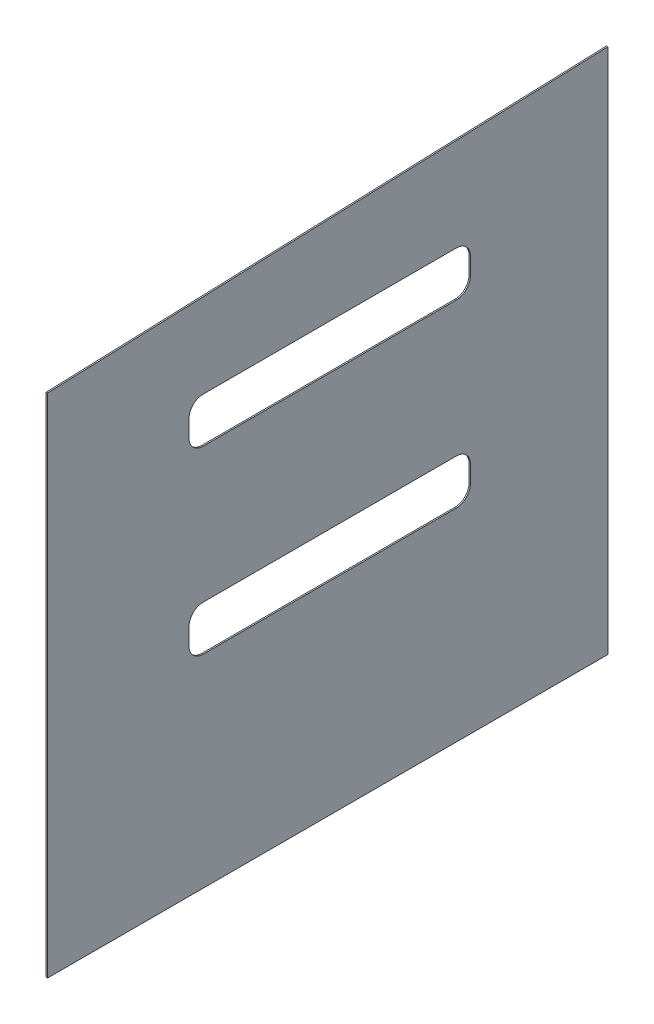
ISO-10303-21;
HEADER;
FILE_DESCRIPTION(('STEP AP214'),'2;1');
FILE_NAME('part.step','',(''),(''),'','','');
FILE_SCHEMA(('AUTOMOTIVE_DESIGN { 1 0 10303 214 1 1 1 1 }'));
ENDSEC;
DATA;
#1=APPLICATION_CONTEXT('core data for automotive mechanical design processes');
#2=APPLICATION_PROTOCOL_DEFINITION('international standard','automotive_design',2000,#1);
#3=PRODUCT_CONTEXT('',#1,'mechanical');
#4=PRODUCT('Part','Part','',(#3));
#5=PRODUCT_RELATED_PRODUCT_CATEGORY('part','',(#4));
#6=PRODUCT_DEFINITION_FORMATION('','',#4);
#7=PRODUCT_DEFINITION_CONTEXT('part definition',#1,'design');
#8=PRODUCT_DEFINITION('design','',#6,#7);
#9=PRODUCT_DEFINITION_SHAPE('','',#8);
#10=(LENGTH_UNIT() NAMED_UNIT(*) SI_UNIT(.MILLI.,.METRE.));
#11=(NAMED_UNIT(*) PLANE_ANGLE_UNIT() SI_UNIT($,.RADIAN.));
#12=(NAMED_UNIT(*) SI_UNIT($,.STERADIAN.) SOLID_ANGLE_UNIT());
#13=UNCERTAINTY_MEASURE_WITH_UNIT(LENGTH_MEASURE(1.E-05),#10,'distance_accuracy_value','');
#14=(GEOMETRIC_REPRESENTATION_CONTEXT(3) GLOBAL_UNCERTAINTY_ASSIGNED_CONTEXT((#13)) GLOBAL_UNIT_ASSIGNED_CONTEXT((#10,
#11,#12)) REPRESENTATION_CONTEXT('',''));
#15=CARTESIAN_POINT('',(0.,0.,0.));
#16=DIRECTION('',(0.,0.,1.));
#17=DIRECTION('',(1.,0.,0.));
#18=AXIS2_PLACEMENT_3D('',#15,#16,#17);
#19=CARTESIAN_POINT('',(6.35,1838.45729166667,746.398166827347));
#20=DIRECTION('',(0.,0.,-1.));
#21=DIRECTION('',(0.,1.,0.));
#22=AXIS2_PLACEMENT_3D('',#19,#20,#21);
#23=PLANE('',#22);
#24=DIRECTION('',(0.,-1.,0.));
#25=VECTOR('',#24,1.);
#26=CARTESIAN_POINT('',(0.,1838.45729166667,746.398166827347));
#27=LINE('',#26,#25);
#28=CARTESIAN_POINT('',(0.,1838.45729166667,746.398166827347));
#29=VERTEX_POINT('',#28);
#30=CARTESIAN_POINT('',(0.,-447.542708333333,746.398166827347));
#31=VERTEX_POINT('',#30);
#32=EDGE_CURVE('E217',#29,#31,#27,.T.);
#33=ORIENTED_EDGE('',*,*,#32,.T.);
#34=DIRECTION('',(-1.,0.,0.));
#35=VECTOR('',#34,1.);
#36=CARTESIAN_POINT('',(6.35,-447.542708333333,746.398166827347));
#37=LINE('',#36,#35);
#38=CARTESIAN_POINT('',(6.35,-447.542708333333,746.398166827347));
#39=VERTEX_POINT('',#38);
#40=EDGE_CURVE('E292',#39,#31,#37,.T.);
#41=ORIENTED_EDGE('',*,*,#40,.F.);
#42=DIRECTION('',(0.,-1.,0.));
#43=VECTOR('',#42,1.);
#44=CARTESIAN_POINT('',(6.35,1838.45729166667,746.398166827347));
#45=LINE('',#44,#43);
#46=CARTESIAN_POINT('',(6.35,1838.45729166667,746.398166827347));
#47=VERTEX_POINT('',#46);
#48=EDGE_CURVE('E266',#47,#39,#45,.T.);
#49=ORIENTED_EDGE('',*,*,#48,.F.);
#50=DIRECTION('',(-1.,0.,0.));
#51=VECTOR('',#50,1.);
#52=CARTESIAN_POINT('',(6.35,1838.45729166667,746.398166827347));
#53=LINE('',#52,#51);
#54=EDGE_CURVE('E276',#47,#29,#53,.T.);
#55=ORIENTED_EDGE('',*,*,#54,.T.);
#56=EDGE_LOOP('',(#33,#41,#49,#55));
#57=FACE_BOUND('',#56,.T.);
#58=ADVANCED_FACE('F37',(#57),#23,.F.);
#59=CARTESIAN_POINT('',(6.35,-447.542708333333,746.398166827347));
#60=DIRECTION('',(0.,1.,0.));
#61=DIRECTION('',(0.,0.,1.));
#62=AXIS2_PLACEMENT_3D('',#59,#60,#61);
#63=PLANE('',#62);
#64=DIRECTION('',(0.,0.,-1.));
#65=VECTOR('',#64,1.);
#66=CARTESIAN_POINT('',(0.,-447.542708333333,746.398166827347));
#67=LINE('',#66,#65);
#68=CARTESIAN_POINT('',(0.,-447.542708333332,-1780.90183317265));
#69=VERTEX_POINT('',#68);
#70=EDGE_CURVE('E279',#31,#69,#67,.T.);
#71=ORIENTED_EDGE('',*,*,#70,.T.);
#72=DIRECTION('',(-1.,0.,0.));
#73=VECTOR('',#72,1.);
#74=CARTESIAN_POINT('',(6.35,-447.542708333332,-1780.90183317265));
#75=LINE('',#74,#73);
#76=CARTESIAN_POINT('',(6.35,-447.542708333332,-1780.90183317265));
#77=VERTEX_POINT('',#76);
#78=EDGE_CURVE('E289',#77,#69,#75,.T.);
#79=ORIENTED_EDGE('',*,*,#78,.F.);
#80=DIRECTION('',(0.,0.,-1.));
#81=VECTOR('',#80,1.);
#82=CARTESIAN_POINT('',(6.35,-447.542708333333,746.398166827347));
#83=LINE('',#82,#81);
#84=EDGE_CURVE('E269',#39,#77,#83,.T.);
#85=ORIENTED_EDGE('',*,*,#84,.F.);
#86=ORIENTED_EDGE('',*,*,#40,.T.);
#87=EDGE_LOOP('',(#71,#79,#85,#86));
#88=FACE_BOUND('',#87,.T.);
#89=ADVANCED_FACE('F370',(#88),#63,.F.);
#90=CARTESIAN_POINT('',(6.35,-447.542708333332,-1780.90183317265));
#91=DIRECTION('',(0.,0.,1.));
#92=DIRECTION('',(0.,-1.,0.));
#93=AXIS2_PLACEMENT_3D('',#90,#91,#92);
#94=PLANE('',#93);
#95=DIRECTION('',(0.,1.,0.));
#96=VECTOR('',#95,1.);
#97=CARTESIAN_POINT('',(0.,-447.542708333332,-1780.90183317265));
#98=LINE('',#97,#96);
#99=CARTESIAN_POINT('',(0.,1927.35729166667,-1780.90183317265));
#100=VERTEX_POINT('',#99);
#101=EDGE_CURVE('E281',#69,#100,#98,.T.);
#102=ORIENTED_EDGE('',*,*,#101,.T.);
#103=DIRECTION('',(-1.,0.,0.));
#104=VECTOR('',#103,1.);
#105=CARTESIAN_POINT('',(6.35,1927.35729166667,-1780.90183317265));
#106=LINE('',#105,#104);
#107=CARTESIAN_POINT('',(6.35,1927.35729166667,-1780.90183317265));
#108=VERTEX_POINT('',#107);
#109=EDGE_CURVE('E286',#108,#100,#106,.T.);
#110=ORIENTED_EDGE('',*,*,#109,.F.);
#111=DIRECTION('',(0.,1.,0.));
#112=VECTOR('',#111,1.);
#113=CARTESIAN_POINT('',(6.35,-447.542708333332,-1780.90183317265));
#114=LINE('',#113,#112);
#115=EDGE_CURVE('E272',#77,#108,#114,.T.);
#116=ORIENTED_EDGE('',*,*,#115,.F.);
#117=ORIENTED_EDGE('',*,*,#78,.T.);
#118=EDGE_LOOP('',(#102,#110,#116,#117));
#119=FACE_BOUND('',#118,.T.);
#120=ADVANCED_FACE('F375',(#119),#94,.F.);
#121=CARTESIAN_POINT('',(6.35,1927.35729166667,-1780.90183317265));
#122=DIRECTION('',(0.,-0.999381902294133,-0.035154137266628));
#123=DIRECTION('',(0.,0.035154137266628,-0.999381902294133));
#124=AXIS2_PLACEMENT_3D('',#121,#122,#123);
#125=PLANE('',#124);
#126=DIRECTION('',(0.,-0.035154137266628,0.999381902294133));
#127=VECTOR('',#126,1.);
#128=CARTESIAN_POINT('',(0.,1927.35729166667,-1780.90183317265));
#129=LINE('',#128,#127);
#130=EDGE_CURVE('E270',#100,#29,#129,.T.);
#131=ORIENTED_EDGE('',*,*,#130,.T.);
#132=ORIENTED_EDGE('',*,*,#54,.F.);
#133=DIRECTION('',(0.,-0.035154137266628,0.999381902294133));
#134=VECTOR('',#133,1.);
#135=CARTESIAN_POINT('',(6.35,1927.35729166667,-1780.90183317265));
#136=LINE('',#135,#134);
#137=EDGE_CURVE('E274',#108,#47,#136,.T.);
#138=ORIENTED_EDGE('',*,*,#137,.F.);
#139=ORIENTED_EDGE('',*,*,#109,.T.);
#140=EDGE_LOOP('',(#131,#132,#138,#139));
#141=FACE_BOUND('',#140,.T.);
#142=ADVANCED_FACE('F390',(#141),#125,.F.);
#143=CARTESIAN_POINT('',(6.35,0.,0.));
#144=DIRECTION('',(1.,0.,0.));
#145=DIRECTION('',(0.,0.,-1.));
#146=AXIS2_PLACEMENT_3D('',#143,#144,#145);
#147=PLANE('',#146);
#148=CARTESIAN_POINT('',(6.35,606.557291666667,45.100318003957));
#149=DIRECTION('',(1.,0.,0.));
#150=DIRECTION('',(0.,0.,-1.));
#151=AXIS2_PLACEMENT_3D('',#148,#149,#150);
#152=CIRCLE('',#151,63.5);
#153=CARTESIAN_POINT('',(6.35,670.057291666667,45.1003180039565));
#154=VERTEX_POINT('',#153);
#155=CARTESIAN_POINT('',(6.35,606.557291666667,108.600318003957));
#156=VERTEX_POINT('',#155);
#157=EDGE_CURVE('E51',#154,#156,#152,.T.);
#158=ORIENTED_EDGE('',*,*,#157,.F.);
#159=DIRECTION('',(0.,0.,1.));
#160=VECTOR('',#159,1.);
#161=CARTESIAN_POINT('',(6.35,670.057291666667,45.1003180039565));
#162=LINE('',#161,#160);
#163=CARTESIAN_POINT('',(6.35,670.057291666667,-1097.89968199604));
#164=VERTEX_POINT('',#163);
#165=EDGE_CURVE('E212',#164,#154,#162,.T.);
#166=ORIENTED_EDGE('',*,*,#165,.F.);
#167=CARTESIAN_POINT('',(6.35,606.557291666667,-1097.89968199604));
#168=DIRECTION('',(1.,0.,0.));
#169=DIRECTION('',(0.,0.,1.));
#170=AXIS2_PLACEMENT_3D('',#167,#168,#169);
#171=CIRCLE('',#170,63.4999999999999);
#172=CARTESIAN_POINT('',(6.35,606.557291666667,-1161.39968199604));
#173=VERTEX_POINT('',#172);
#174=EDGE_CURVE('E209',#173,#164,#171,.T.);
#175=ORIENTED_EDGE('',*,*,#174,.F.);
#176=DIRECTION('',(0.,1.,0.));
#177=VECTOR('',#176,1.);
#178=CARTESIAN_POINT('',(6.35,606.557291666667,-1161.39968199604));
#179=LINE('',#178,#177);
#180=CARTESIAN_POINT('',(6.35,530.357291666667,-1161.39968199604));
#181=VERTEX_POINT('',#180);
#182=EDGE_CURVE('E206',#181,#173,#179,.T.);
#183=ORIENTED_EDGE('',*,*,#182,.F.);
#184=CARTESIAN_POINT('',(6.35,530.357291666667,-1097.89968199604));
#185=DIRECTION('',(1.,0.,0.));
#186=DIRECTION('',(0.,0.,-1.));
#187=AXIS2_PLACEMENT_3D('',#184,#185,#186);
#188=CIRCLE('',#187,63.4999999999999);
#189=CARTESIAN_POINT('',(6.35,466.857291666667,-1097.89968199604));
#190=VERTEX_POINT('',#189);
#191=EDGE_CURVE('E200',#190,#181,#188,.T.);
#192=ORIENTED_EDGE('',*,*,#191,.F.);
#193=DIRECTION('',(0.,0.,-1.));
#194=VECTOR('',#193,1.);
#195=CARTESIAN_POINT('',(6.35,466.857291666667,45.1003180039565));
#196=LINE('',#195,#194);
#197=CARTESIAN_POINT('',(6.35,466.857291666667,45.1003180039565));
#198=VERTEX_POINT('',#197);
#199=EDGE_CURVE('E198',#198,#190,#196,.T.);
#200=ORIENTED_EDGE('',*,*,#199,.F.);
#201=CARTESIAN_POINT('',(6.35,530.357291666667,45.100318003957));
#202=DIRECTION('',(1.,0.,0.));
#203=DIRECTION('',(0.,0.,-1.));
#204=AXIS2_PLACEMENT_3D('',#201,#202,#203);
#205=CIRCLE('',#204,63.5);
#206=CARTESIAN_POINT('',(6.35,530.357291666667,108.600318003957));
#207=VERTEX_POINT('',#206);
#208=EDGE_CURVE('E180',#207,#198,#205,.T.);
#209=ORIENTED_EDGE('',*,*,#208,.F.);
#210=DIRECTION('',(0.,-1.,0.));
#211=VECTOR('',#210,1.);
#212=CARTESIAN_POINT('',(6.35,606.557291666667,108.600318003957));
#213=LINE('',#212,#211);
#214=EDGE_CURVE('E190',#156,#207,#213,.T.);
#215=ORIENTED_EDGE('',*,*,#214,.F.);
#216=EDGE_LOOP('',(#158,#166,#175,#183,#192,#200,#209,#215));
#217=FACE_BOUND('',#216,.T.);
#218=CARTESIAN_POINT('',(6.35,1343.15729166667,-1097.89968199604));
#219=DIRECTION('',(1.,0.,0.));
#220=DIRECTION('',(0.,0.,1.));
#221=AXIS2_PLACEMENT_3D('',#218,#219,#220);
#222=CIRCLE('',#221,63.4999999999999);
#223=CARTESIAN_POINT('',(6.35,1279.65729166667,-1097.89968199604));
#224=VERTEX_POINT('',#223);
#225=CARTESIAN_POINT('',(6.35,1343.15729166667,-1161.39968199604));
#226=VERTEX_POINT('',#225);
#227=EDGE_CURVE('E59',#224,#226,#222,.T.);
#228=ORIENTED_EDGE('',*,*,#227,.F.);
#229=DIRECTION('',(0.,0.,-1.));
#230=VECTOR('',#229,1.);
#231=CARTESIAN_POINT('',(6.35,1279.65729166667,-1097.89968199604));
#232=LINE('',#231,#230);
#233=CARTESIAN_POINT('',(6.35,1279.65729166667,45.1003180039563));
#234=VERTEX_POINT('',#233);
#235=EDGE_CURVE('E247',#234,#224,#232,.T.);
#236=ORIENTED_EDGE('',*,*,#235,.F.);
#237=CARTESIAN_POINT('',(6.35,1343.15729166667,45.1003180039567));
#238=DIRECTION('',(1.,0.,0.));
#239=DIRECTION('',(0.,0.,1.));
#240=AXIS2_PLACEMENT_3D('',#237,#238,#239);
#241=CIRCLE('',#240,63.5000000000001);
#242=CARTESIAN_POINT('',(6.35,1343.15729166667,108.600318003957));
#243=VERTEX_POINT('',#242);
#244=EDGE_CURVE('E244',#243,#234,#241,.T.);
#245=ORIENTED_EDGE('',*,*,#244,.F.);
#246=DIRECTION('',(0.,-1.,0.));
#247=VECTOR('',#246,1.);
#248=CARTESIAN_POINT('',(6.35,1419.35729166667,108.600318003957));
#249=LINE('',#248,#247);
#250=CARTESIAN_POINT('',(6.35,1419.35729166667,108.600318003957));
#251=VERTEX_POINT('',#250);
#252=EDGE_CURVE('E241',#251,#243,#249,.T.);
#253=ORIENTED_EDGE('',*,*,#252,.F.);
#254=CARTESIAN_POINT('',(6.35,1419.35729166667,45.1003180039567));
#255=DIRECTION('',(1.,0.,0.));
#256=DIRECTION('',(0.,0.,-1.));
#257=AXIS2_PLACEMENT_3D('',#254,#255,#256);
#258=CIRCLE('',#257,63.4999999999999);
#259=CARTESIAN_POINT('',(6.35,1482.85729166667,45.1003180039563));
#260=VERTEX_POINT('',#259);
#261=EDGE_CURVE('E238',#260,#251,#258,.T.);
#262=ORIENTED_EDGE('',*,*,#261,.F.);
#263=DIRECTION('',(0.,0.,1.));
#264=VECTOR('',#263,1.);
#265=CARTESIAN_POINT('',(6.35,1482.85729166667,-1097.89968199604));
#266=LINE('',#265,#264);
#267=CARTESIAN_POINT('',(6.35,1482.85729166667,-1097.89968199604));
#268=VERTEX_POINT('',#267);
#269=EDGE_CURVE('E235',#268,#260,#266,.T.);
#270=ORIENTED_EDGE('',*,*,#269,.F.);
#271=CARTESIAN_POINT('',(6.35,1419.35729166667,-1097.89968199604));
#272=DIRECTION('',(1.,0.,0.));
#273=DIRECTION('',(0.,0.,1.));
#274=AXIS2_PLACEMENT_3D('',#271,#272,#273);
#275=CIRCLE('',#274,63.5000000000001);
#276=CARTESIAN_POINT('',(6.35,1419.35729166667,-1161.39968199604));
#277=VERTEX_POINT('',#276);
#278=EDGE_CURVE('E232',#277,#268,#275,.T.);
#279=ORIENTED_EDGE('',*,*,#278,.F.);
#280=DIRECTION('',(0.,1.,0.));
#281=VECTOR('',#280,1.);
#282=CARTESIAN_POINT('',(6.35,1419.35729166667,-1161.39968199604));
#283=LINE('',#282,#281);
#284=EDGE_CURVE('E229',#226,#277,#283,.T.);
#285=ORIENTED_EDGE('',*,*,#284,.F.);
#286=EDGE_LOOP('',(#228,#236,#245,#253,#262,#270,#279,#285));
#287=FACE_BOUND('',#286,.T.);
#288=ORIENTED_EDGE('',*,*,#48,.T.);
#289=ORIENTED_EDGE('',*,*,#84,.T.);
#290=ORIENTED_EDGE('',*,*,#115,.T.);
#291=ORIENTED_EDGE('',*,*,#137,.T.);
#292=EDGE_LOOP('',(#288,#289,#290,#291));
#293=FACE_BOUND('',#292,.T.);
#294=ADVANCED_FACE('F194',(#217,#287,#293),#147,.T.);
#295=CARTESIAN_POINT('',(0.,0.,0.));
#296=DIRECTION('',(1.,0.,0.));
#297=DIRECTION('',(0.,0.,-1.));
#298=AXIS2_PLACEMENT_3D('',#295,#296,#297);
#299=PLANE('',#298);
#300=DIRECTION('',(0.,0.,1.));
#301=VECTOR('',#300,1.);
#302=CARTESIAN_POINT('',(0.,670.057291666667,0.));
#303=LINE('',#302,#301);
#304=CARTESIAN_POINT('',(0.,670.057291666667,-1097.89968199604));
#305=VERTEX_POINT('',#304);
#306=CARTESIAN_POINT('',(0.,670.057291666667,45.1003180039565));
#307=VERTEX_POINT('',#306);
#308=EDGE_CURVE('E44',#305,#307,#303,.T.);
#309=ORIENTED_EDGE('',*,*,#308,.T.);
#310=CARTESIAN_POINT('',(0.,606.557291666667,45.100318003957));
#311=DIRECTION('',(1.,0.,0.));
#312=DIRECTION('',(0.,0.,-1.));
#313=AXIS2_PLACEMENT_3D('',#310,#311,#312);
#314=CIRCLE('',#313,63.5);
#315=CARTESIAN_POINT('',(0.,606.557291666667,108.600318003957));
#316=VERTEX_POINT('',#315);
#317=EDGE_CURVE('E11',#307,#316,#314,.T.);
#318=ORIENTED_EDGE('',*,*,#317,.T.);
#319=DIRECTION('',(0.,-1.,0.));
#320=VECTOR('',#319,1.);
#321=CARTESIAN_POINT('',(0.,0.,108.600318003957));
#322=LINE('',#321,#320);
#323=CARTESIAN_POINT('',(0.,530.357291666667,108.600318003957));
#324=VERTEX_POINT('',#323);
#325=EDGE_CURVE('E319',#316,#324,#322,.T.);
#326=ORIENTED_EDGE('',*,*,#325,.T.);
#327=CARTESIAN_POINT('',(0.,530.357291666667,45.100318003957));
#328=DIRECTION('',(1.,0.,0.));
#329=DIRECTION('',(0.,0.,-1.));
#330=AXIS2_PLACEMENT_3D('',#327,#328,#329);
#331=CIRCLE('',#330,63.5);
#332=CARTESIAN_POINT('',(0.,466.857291666667,45.1003180039565));
#333=VERTEX_POINT('',#332);
#334=EDGE_CURVE('E183',#324,#333,#331,.T.);
#335=ORIENTED_EDGE('',*,*,#334,.T.);
#336=DIRECTION('',(0.,0.,-1.));
#337=VECTOR('',#336,1.);
#338=CARTESIAN_POINT('',(0.,466.857291666667,0.));
#339=LINE('',#338,#337);
#340=CARTESIAN_POINT('',(0.,466.857291666667,-1097.89968199604));
#341=VERTEX_POINT('',#340);
#342=EDGE_CURVE('E322',#333,#341,#339,.T.);
#343=ORIENTED_EDGE('',*,*,#342,.T.);
#344=CARTESIAN_POINT('',(0.,530.357291666667,-1097.89968199604));
#345=DIRECTION('',(1.,0.,0.));
#346=DIRECTION('',(0.,0.,-1.));
#347=AXIS2_PLACEMENT_3D('',#344,#345,#346);
#348=CIRCLE('',#347,63.4999999999999);
#349=CARTESIAN_POINT('',(0.,530.357291666667,-1161.39968199604));
#350=VERTEX_POINT('',#349);
#351=EDGE_CURVE('E325',#341,#350,#348,.T.);
#352=ORIENTED_EDGE('',*,*,#351,.T.);
#353=DIRECTION('',(0.,1.,0.));
#354=VECTOR('',#353,1.);
#355=CARTESIAN_POINT('',(0.,0.,-1161.39968199604));
#356=LINE('',#355,#354);
#357=CARTESIAN_POINT('',(0.,606.557291666667,-1161.39968199604));
#358=VERTEX_POINT('',#357);
#359=EDGE_CURVE('E328',#350,#358,#356,.T.);
#360=ORIENTED_EDGE('',*,*,#359,.T.);
#361=CARTESIAN_POINT('',(0.,606.557291666667,-1097.89968199604));
#362=DIRECTION('',(1.,0.,0.));
#363=DIRECTION('',(0.,0.,-1.));
#364=AXIS2_PLACEMENT_3D('',#361,#362,#363);
#365=CIRCLE('',#364,63.4999999999999);
#366=EDGE_CURVE('E331',#358,#305,#365,.T.);
#367=ORIENTED_EDGE('',*,*,#366,.T.);
#368=EDGE_LOOP('',(#309,#318,#326,#335,#343,#352,#360,#367));
#369=FACE_BOUND('',#368,.T.);
#370=DIRECTION('',(0.,0.,-1.));
#371=VECTOR('',#370,1.);
#372=CARTESIAN_POINT('',(0.,1279.65729166667,2.48592299009239E-13));
#373=LINE('',#372,#371);
#374=CARTESIAN_POINT('',(0.,1279.65729166667,45.1003180039563));
#375=VERTEX_POINT('',#374);
#376=CARTESIAN_POINT('',(0.,1279.65729166667,-1097.89968199604));
#377=VERTEX_POINT('',#376);
#378=EDGE_CURVE('E313',#375,#377,#373,.T.);
#379=ORIENTED_EDGE('',*,*,#378,.T.);
#380=CARTESIAN_POINT('',(0.,1343.15729166667,-1097.89968199604));
#381=DIRECTION('',(1.,0.,0.));
#382=DIRECTION('',(0.,0.,-1.));
#383=AXIS2_PLACEMENT_3D('',#380,#381,#382);
#384=CIRCLE('',#383,63.4999999999999);
#385=CARTESIAN_POINT('',(0.,1343.15729166667,-1161.39968199604));
#386=VERTEX_POINT('',#385);
#387=EDGE_CURVE('E316',#377,#386,#384,.T.);
#388=ORIENTED_EDGE('',*,*,#387,.T.);
#389=DIRECTION('',(0.,1.,0.));
#390=VECTOR('',#389,1.);
#391=CARTESIAN_POINT('',(0.,-3.38428521717678E-12,-1161.39968199604));
#392=LINE('',#391,#390);
#393=CARTESIAN_POINT('',(0.,1419.35729166667,-1161.39968199604));
#394=VERTEX_POINT('',#393);
#395=EDGE_CURVE('E295',#386,#394,#392,.T.);
#396=ORIENTED_EDGE('',*,*,#395,.T.);
#397=CARTESIAN_POINT('',(0.,1419.35729166667,-1097.89968199604));
#398=DIRECTION('',(1.,0.,0.));
#399=DIRECTION('',(0.,0.,-1.));
#400=AXIS2_PLACEMENT_3D('',#397,#398,#399);
#401=CIRCLE('',#400,63.5000000000001);
#402=CARTESIAN_POINT('',(0.,1482.85729166667,-1097.89968199604));
#403=VERTEX_POINT('',#402);
#404=EDGE_CURVE('E298',#394,#403,#401,.T.);
#405=ORIENTED_EDGE('',*,*,#404,.T.);
#406=DIRECTION('',(0.,0.,1.));
#407=VECTOR('',#406,1.);
#408=CARTESIAN_POINT('',(0.,1482.85729166667,2.88066895440356E-13));
#409=LINE('',#408,#407);
#410=CARTESIAN_POINT('',(0.,1482.85729166667,45.1003180039563));
#411=VERTEX_POINT('',#410);
#412=EDGE_CURVE('E301',#403,#411,#409,.T.);
#413=ORIENTED_EDGE('',*,*,#412,.T.);
#414=CARTESIAN_POINT('',(0.,1419.35729166667,45.1003180039567));
#415=DIRECTION('',(1.,0.,0.));
#416=DIRECTION('',(0.,0.,-1.));
#417=AXIS2_PLACEMENT_3D('',#414,#415,#416);
#418=CIRCLE('',#417,63.4999999999999);
#419=CARTESIAN_POINT('',(0.,1419.35729166667,108.600318003957));
#420=VERTEX_POINT('',#419);
#421=EDGE_CURVE('E304',#411,#420,#418,.T.);
#422=ORIENTED_EDGE('',*,*,#421,.T.);
#423=DIRECTION('',(0.,-1.,0.));
#424=VECTOR('',#423,1.);
#425=CARTESIAN_POINT('',(0.,0.,108.600318003956));
#426=LINE('',#425,#424);
#427=CARTESIAN_POINT('',(0.,1343.15729166667,108.600318003957));
#428=VERTEX_POINT('',#427);
#429=EDGE_CURVE('E307',#420,#428,#426,.T.);
#430=ORIENTED_EDGE('',*,*,#429,.T.);
#431=CARTESIAN_POINT('',(0.,1343.15729166667,45.1003180039567));
#432=DIRECTION('',(1.,0.,0.));
#433=DIRECTION('',(0.,0.,-1.));
#434=AXIS2_PLACEMENT_3D('',#431,#432,#433);
#435=CIRCLE('',#434,63.5000000000001);
#436=EDGE_CURVE('E310',#428,#375,#435,.T.);
#437=ORIENTED_EDGE('',*,*,#436,.T.);
#438=EDGE_LOOP('',(#379,#388,#396,#405,#413,#422,#430,#437));
#439=FACE_BOUND('',#438,.T.);
#440=ORIENTED_EDGE('',*,*,#32,.F.);
#441=ORIENTED_EDGE('',*,*,#130,.F.);
#442=ORIENTED_EDGE('',*,*,#101,.F.);
#443=ORIENTED_EDGE('',*,*,#70,.F.);
#444=EDGE_LOOP('',(#440,#441,#442,#443));
#445=FACE_BOUND('',#444,.T.);
#446=ADVANCED_FACE('F335',(#369,#439,#445),#299,.F.);
#447=CARTESIAN_POINT('',(-44.45,1343.15729166667,-1097.89968199604));
#448=DIRECTION('',(1.,0.,0.));
#449=DIRECTION('',(0.,0.,-1.));
#450=AXIS2_PLACEMENT_3D('',#447,#448,#449);
#451=CYLINDRICAL_SURFACE('',#450,63.4999999999999);
#452=DIRECTION('',(1.,0.,0.));
#453=VECTOR('',#452,1.);
#454=CARTESIAN_POINT('',(-44.45,1279.65729166667,-1097.89968199604));
#455=LINE('',#454,#453);
#456=EDGE_CURVE('E251',#377,#224,#455,.T.);
#457=ORIENTED_EDGE('',*,*,#456,.T.);
#458=ORIENTED_EDGE('',*,*,#227,.T.);
#459=DIRECTION('',(1.,0.,0.));
#460=VECTOR('',#459,1.);
#461=CARTESIAN_POINT('',(-44.45,1343.15729166667,-1161.39968199604));
#462=LINE('',#461,#460);
#463=EDGE_CURVE('E250',#386,#226,#462,.T.);
#464=ORIENTED_EDGE('',*,*,#463,.F.);
#465=ORIENTED_EDGE('',*,*,#387,.F.);
#466=EDGE_LOOP('',(#457,#458,#464,#465));
#467=FACE_BOUND('',#466,.T.);
#468=ADVANCED_FACE('F401',(#467),#451,.F.);
#469=CARTESIAN_POINT('',(-44.45,1279.65729166667,-1097.89968199604));
#470=DIRECTION('',(0.,-1.,0.));
#471=DIRECTION('',(0.,0.,-1.));
#472=AXIS2_PLACEMENT_3D('',#469,#470,#471);
#473=PLANE('',#472);
#474=DIRECTION('',(1.,0.,0.));
#475=VECTOR('',#474,1.);
#476=CARTESIAN_POINT('',(-44.45,1279.65729166667,45.1003180039563));
#477=LINE('',#476,#475);
#478=EDGE_CURVE('E253',#375,#234,#477,.T.);
#479=ORIENTED_EDGE('',*,*,#478,.T.);
#480=ORIENTED_EDGE('',*,*,#235,.T.);
#481=ORIENTED_EDGE('',*,*,#456,.F.);
#482=ORIENTED_EDGE('',*,*,#378,.F.);
#483=EDGE_LOOP('',(#479,#480,#481,#482));
#484=FACE_BOUND('',#483,.T.);
#485=ADVANCED_FACE('F405',(#484),#473,.F.);
#486=CARTESIAN_POINT('',(-44.45,1343.15729166667,45.1003180039567));
#487=DIRECTION('',(1.,0.,0.));
#488=DIRECTION('',(0.,0.,-1.));
#489=AXIS2_PLACEMENT_3D('',#486,#487,#488);
#490=CYLINDRICAL_SURFACE('',#489,63.5000000000001);
#491=DIRECTION('',(1.,0.,0.));
#492=VECTOR('',#491,1.);
#493=CARTESIAN_POINT('',(-44.45,1343.15729166667,108.600318003957));
#494=LINE('',#493,#492);
#495=EDGE_CURVE('E255',#428,#243,#494,.T.);
#496=ORIENTED_EDGE('',*,*,#495,.T.);
#497=ORIENTED_EDGE('',*,*,#244,.T.);
#498=ORIENTED_EDGE('',*,*,#478,.F.);
#499=ORIENTED_EDGE('',*,*,#436,.F.);
#500=EDGE_LOOP('',(#496,#497,#498,#499));
#501=FACE_BOUND('',#500,.T.);
#502=ADVANCED_FACE('F421',(#501),#490,.F.);
#503=CARTESIAN_POINT('',(-44.45,1419.35729166667,108.600318003957));
#504=DIRECTION('',(0.,0.,1.));
#505=DIRECTION('',(0.,-1.,0.));
#506=AXIS2_PLACEMENT_3D('',#503,#504,#505);
#507=PLANE('',#506);
#508=DIRECTION('',(1.,0.,0.));
#509=VECTOR('',#508,1.);
#510=CARTESIAN_POINT('',(-44.45,1419.35729166667,108.600318003957));
#511=LINE('',#510,#509);
#512=EDGE_CURVE('E257',#420,#251,#511,.T.);
#513=ORIENTED_EDGE('',*,*,#512,.T.);
#514=ORIENTED_EDGE('',*,*,#252,.T.);
#515=ORIENTED_EDGE('',*,*,#495,.F.);
#516=ORIENTED_EDGE('',*,*,#429,.F.);
#517=EDGE_LOOP('',(#513,#514,#515,#516));
#518=FACE_BOUND('',#517,.T.);
#519=ADVANCED_FACE('F417',(#518),#507,.F.);
#520=CARTESIAN_POINT('',(-44.45,1419.35729166667,45.1003180039567));
#521=DIRECTION('',(1.,0.,0.));
#522=DIRECTION('',(0.,0.,-1.));
#523=AXIS2_PLACEMENT_3D('',#520,#521,#522);
#524=CYLINDRICAL_SURFACE('',#523,63.4999999999999);
#525=DIRECTION('',(1.,0.,0.));
#526=VECTOR('',#525,1.);
#527=CARTESIAN_POINT('',(-44.45,1482.85729166667,45.1003180039563));
#528=LINE('',#527,#526);
#529=EDGE_CURVE('E259',#411,#260,#528,.T.);
#530=ORIENTED_EDGE('',*,*,#529,.T.);
#531=ORIENTED_EDGE('',*,*,#261,.T.);
#532=ORIENTED_EDGE('',*,*,#512,.F.);
#533=ORIENTED_EDGE('',*,*,#421,.F.);
#534=EDGE_LOOP('',(#530,#531,#532,#533));
#535=FACE_BOUND('',#534,.T.);
#536=ADVANCED_FACE('F413',(#535),#524,.F.);
#537=CARTESIAN_POINT('',(-44.45,1482.85729166667,-1097.89968199604));
#538=DIRECTION('',(0.,1.,0.));
#539=DIRECTION('',(0.,0.,1.));
#540=AXIS2_PLACEMENT_3D('',#537,#538,#539);
#541=PLANE('',#540);
#542=DIRECTION('',(1.,0.,0.));
#543=VECTOR('',#542,1.);
#544=CARTESIAN_POINT('',(-44.45,1482.85729166667,-1097.89968199604));
#545=LINE('',#544,#543);
#546=EDGE_CURVE('E261',#403,#268,#545,.T.);
#547=ORIENTED_EDGE('',*,*,#546,.T.);
#548=ORIENTED_EDGE('',*,*,#269,.T.);
#549=ORIENTED_EDGE('',*,*,#529,.F.);
#550=ORIENTED_EDGE('',*,*,#412,.F.);
#551=EDGE_LOOP('',(#547,#548,#549,#550));
#552=FACE_BOUND('',#551,.T.);
#553=ADVANCED_FACE('F409',(#552),#541,.F.);
#554=CARTESIAN_POINT('',(-44.45,1419.35729166667,-1097.89968199604));
#555=DIRECTION('',(1.,0.,0.));
#556=DIRECTION('',(0.,0.,-1.));
#557=AXIS2_PLACEMENT_3D('',#554,#555,#556);
#558=CYLINDRICAL_SURFACE('',#557,63.5000000000001);
#559=DIRECTION('',(1.,0.,0.));
#560=VECTOR('',#559,1.);
#561=CARTESIAN_POINT('',(-44.45,1419.35729166667,-1161.39968199604));
#562=LINE('',#561,#560);
#563=EDGE_CURVE('E263',#394,#277,#562,.T.);
#564=ORIENTED_EDGE('',*,*,#563,.T.);
#565=ORIENTED_EDGE('',*,*,#278,.T.);
#566=ORIENTED_EDGE('',*,*,#546,.F.);
#567=ORIENTED_EDGE('',*,*,#404,.F.);
#568=EDGE_LOOP('',(#564,#565,#566,#567));
#569=FACE_BOUND('',#568,.T.);
#570=ADVANCED_FACE('F364',(#569),#558,.F.);
#571=CARTESIAN_POINT('',(-44.45,1419.35729166667,-1161.39968199604));
#572=DIRECTION('',(0.,0.,-1.));
#573=DIRECTION('',(0.,1.,0.));
#574=AXIS2_PLACEMENT_3D('',#571,#572,#573);
#575=PLANE('',#574);
#576=ORIENTED_EDGE('',*,*,#463,.T.);
#577=ORIENTED_EDGE('',*,*,#284,.T.);
#578=ORIENTED_EDGE('',*,*,#563,.F.);
#579=ORIENTED_EDGE('',*,*,#395,.F.);
#580=EDGE_LOOP('',(#576,#577,#578,#579));
#581=FACE_BOUND('',#580,.T.);
#582=ADVANCED_FACE('F357',(#581),#575,.F.);
#583=CARTESIAN_POINT('',(-44.45,606.557291666667,45.100318003957));
#584=DIRECTION('',(1.,0.,0.));
#585=DIRECTION('',(0.,0.,-1.));
#586=AXIS2_PLACEMENT_3D('',#583,#584,#585);
#587=CYLINDRICAL_SURFACE('',#586,63.5);
#588=DIRECTION('',(1.,0.,0.));
#589=VECTOR('',#588,1.);
#590=CARTESIAN_POINT('',(-44.45,670.057291666667,45.1003180039565));
#591=LINE('',#590,#589);
#592=EDGE_CURVE('E215',#307,#154,#591,.T.);
#593=ORIENTED_EDGE('',*,*,#592,.T.);
#594=ORIENTED_EDGE('',*,*,#157,.T.);
#595=DIRECTION('',(1.,0.,0.));
#596=VECTOR('',#595,1.);
#597=CARTESIAN_POINT('',(-44.45,606.557291666667,108.600318003957));
#598=LINE('',#597,#596);
#599=EDGE_CURVE('E187',#316,#156,#598,.T.);
#600=ORIENTED_EDGE('',*,*,#599,.F.);
#601=ORIENTED_EDGE('',*,*,#317,.F.);
#602=EDGE_LOOP('',(#593,#594,#600,#601));
#603=FACE_BOUND('',#602,.T.);
#604=ADVANCED_FACE('F355',(#603),#587,.F.);
#605=CARTESIAN_POINT('',(-44.45,670.057291666667,45.1003180039565));
#606=DIRECTION('',(0.,1.,0.));
#607=DIRECTION('',(0.,0.,1.));
#608=AXIS2_PLACEMENT_3D('',#605,#606,#607);
#609=PLANE('',#608);
#610=DIRECTION('',(1.,0.,0.));
#611=VECTOR('',#610,1.);
#612=CARTESIAN_POINT('',(-44.45,670.057291666667,-1097.89968199604));
#613=LINE('',#612,#611);
#614=EDGE_CURVE('E218',#305,#164,#613,.T.);
#615=ORIENTED_EDGE('',*,*,#614,.T.);
#616=ORIENTED_EDGE('',*,*,#165,.T.);
#617=ORIENTED_EDGE('',*,*,#592,.F.);
#618=ORIENTED_EDGE('',*,*,#308,.F.);
#619=EDGE_LOOP('',(#615,#616,#617,#618));
#620=FACE_BOUND('',#619,.T.);
#621=ADVANCED_FACE('F340',(#620),#609,.F.);
#622=CARTESIAN_POINT('',(-44.45,606.557291666667,-1097.89968199604));
#623=DIRECTION('',(1.,0.,0.));
#624=DIRECTION('',(0.,0.,-1.));
#625=AXIS2_PLACEMENT_3D('',#622,#623,#624);
#626=CYLINDRICAL_SURFACE('',#625,63.4999999999999);
#627=DIRECTION('',(1.,0.,0.));
#628=VECTOR('',#627,1.);
#629=CARTESIAN_POINT('',(-44.45,606.557291666667,-1161.39968199604));
#630=LINE('',#629,#628);
#631=EDGE_CURVE('E220',#358,#173,#630,.T.);
#632=ORIENTED_EDGE('',*,*,#631,.T.);
#633=ORIENTED_EDGE('',*,*,#174,.T.);
#634=ORIENTED_EDGE('',*,*,#614,.F.);
#635=ORIENTED_EDGE('',*,*,#366,.F.);
#636=EDGE_LOOP('',(#632,#633,#634,#635));
#637=FACE_BOUND('',#636,.T.);
#638=ADVANCED_FACE('F342',(#637),#626,.F.);
#639=CARTESIAN_POINT('',(-44.45,606.557291666667,-1161.39968199604));
#640=DIRECTION('',(0.,0.,-1.));
#641=DIRECTION('',(-1.,0.,0.));
#642=AXIS2_PLACEMENT_3D('',#639,#640,#641);
#643=PLANE('',#642);
#644=DIRECTION('',(1.,0.,0.));
#645=VECTOR('',#644,1.);
#646=CARTESIAN_POINT('',(-44.45,530.357291666667,-1161.39968199604));
#647=LINE('',#646,#645);
#648=EDGE_CURVE('E222',#350,#181,#647,.T.);
#649=ORIENTED_EDGE('',*,*,#648,.T.);
#650=ORIENTED_EDGE('',*,*,#182,.T.);
#651=ORIENTED_EDGE('',*,*,#631,.F.);
#652=ORIENTED_EDGE('',*,*,#359,.F.);
#653=EDGE_LOOP('',(#649,#650,#651,#652));
#654=FACE_BOUND('',#653,.T.);
#655=ADVANCED_FACE('F348',(#654),#643,.F.);
#656=CARTESIAN_POINT('',(-44.45,530.357291666667,-1097.89968199604));
#657=DIRECTION('',(1.,0.,0.));
#658=DIRECTION('',(0.,0.,-1.));
#659=AXIS2_PLACEMENT_3D('',#656,#657,#658);
#660=CYLINDRICAL_SURFACE('',#659,63.4999999999999);
#661=DIRECTION('',(1.,0.,0.));
#662=VECTOR('',#661,1.);
#663=CARTESIAN_POINT('',(-44.45,466.857291666667,-1097.89968199604));
#664=LINE('',#663,#662);
#665=EDGE_CURVE('E224',#341,#190,#664,.T.);
#666=ORIENTED_EDGE('',*,*,#665,.T.);
#667=ORIENTED_EDGE('',*,*,#191,.T.);
#668=ORIENTED_EDGE('',*,*,#648,.F.);
#669=ORIENTED_EDGE('',*,*,#351,.F.);
#670=EDGE_LOOP('',(#666,#667,#668,#669));
#671=FACE_BOUND('',#670,.T.);
#672=ADVANCED_FACE('F351',(#671),#660,.F.);
#673=CARTESIAN_POINT('',(-44.45,466.857291666667,45.1003180039565));
#674=DIRECTION('',(0.,-1.,0.));
#675=DIRECTION('',(0.,0.,-1.));
#676=AXIS2_PLACEMENT_3D('',#673,#674,#675);
#677=PLANE('',#676);
#678=DIRECTION('',(1.,0.,0.));
#679=VECTOR('',#678,1.);
#680=CARTESIAN_POINT('',(-44.45,466.857291666667,45.1003180039565));
#681=LINE('',#680,#679);
#682=EDGE_CURVE('E186',#333,#198,#681,.T.);
#683=ORIENTED_EDGE('',*,*,#682,.T.);
#684=ORIENTED_EDGE('',*,*,#199,.T.);
#685=ORIENTED_EDGE('',*,*,#665,.F.);
#686=ORIENTED_EDGE('',*,*,#342,.F.);
#687=EDGE_LOOP('',(#683,#684,#685,#686));
#688=FACE_BOUND('',#687,.T.);
#689=ADVANCED_FACE('F354',(#688),#677,.F.);
#690=CARTESIAN_POINT('',(-44.45,530.357291666667,45.100318003957));
#691=DIRECTION('',(1.,0.,0.));
#692=DIRECTION('',(0.,0.,-1.));
#693=AXIS2_PLACEMENT_3D('',#690,#691,#692);
#694=CYLINDRICAL_SURFACE('',#693,63.5);
#695=DIRECTION('',(1.,0.,0.));
#696=VECTOR('',#695,1.);
#697=CARTESIAN_POINT('',(-44.45,530.357291666667,108.600318003957));
#698=LINE('',#697,#696);
#699=EDGE_CURVE('E175',#324,#207,#698,.T.);
#700=ORIENTED_EDGE('',*,*,#699,.T.);
#701=ORIENTED_EDGE('',*,*,#208,.T.);
#702=ORIENTED_EDGE('',*,*,#682,.F.);
#703=ORIENTED_EDGE('',*,*,#334,.F.);
#704=EDGE_LOOP('',(#700,#701,#702,#703));
#705=FACE_BOUND('',#704,.T.);
#706=ADVANCED_FACE('F177',(#705),#694,.F.);
#707=CARTESIAN_POINT('',(-44.45,606.557291666667,108.600318003957));
#708=DIRECTION('',(0.,0.,1.));
#709=DIRECTION('',(1.,0.,0.));
#710=AXIS2_PLACEMENT_3D('',#707,#708,#709);
#711=PLANE('',#710);
#712=ORIENTED_EDGE('',*,*,#599,.T.);
#713=ORIENTED_EDGE('',*,*,#214,.T.);
#714=ORIENTED_EDGE('',*,*,#699,.F.);
#715=ORIENTED_EDGE('',*,*,#325,.F.);
#716=EDGE_LOOP('',(#712,#713,#714,#715));
#717=FACE_BOUND('',#716,.T.);
#718=ADVANCED_FACE('F191',(#717),#711,.F.);
#719=CLOSED_SHELL('',(#58,#89,#120,#142,#294,#446,#468,#485,#502,#519,#536,#553,#570,#582,#604,
#621,#638,#655,#672,#689,#706,#718));
#720=MANIFOLD_SOLID_BREP('B2',#719);
#721=ADVANCED_BREP_SHAPE_REPRESENTATION('',(#18,#720),#14);
#722=SHAPE_DEFINITION_REPRESENTATION(#9,#721);
ENDSEC;
END-ISO-10303-21;
